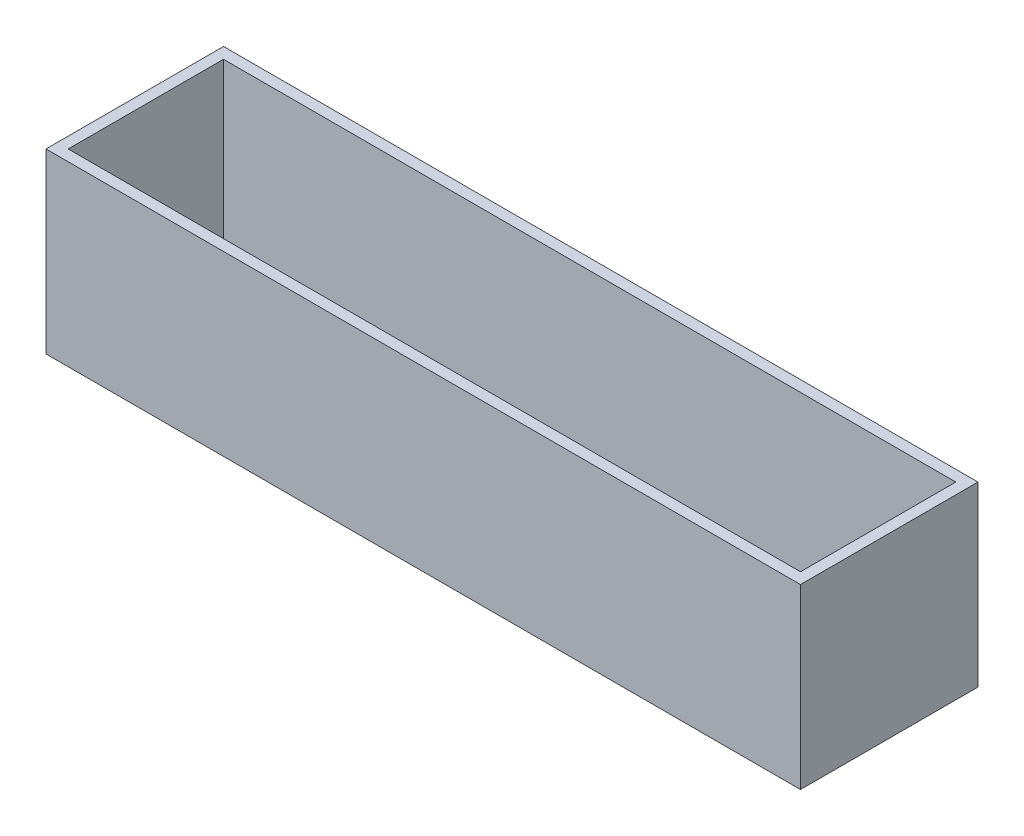
ISO-10303-21;
HEADER;
FILE_DESCRIPTION(('STEP AP214'),'2;1');
FILE_NAME('part.step','',(''),(''),'','','');
FILE_SCHEMA(('AUTOMOTIVE_DESIGN { 1 0 10303 214 1 1 1 1 }'));
ENDSEC;
DATA;
#1=APPLICATION_CONTEXT('core data for automotive mechanical design processes');
#2=APPLICATION_PROTOCOL_DEFINITION('international standard','automotive_design',2000,#1);
#3=PRODUCT_CONTEXT('',#1,'mechanical');
#4=PRODUCT('Part','Part','',(#3));
#5=PRODUCT_RELATED_PRODUCT_CATEGORY('part','',(#4));
#6=PRODUCT_DEFINITION_FORMATION('','',#4);
#7=PRODUCT_DEFINITION_CONTEXT('part definition',#1,'design');
#8=PRODUCT_DEFINITION('design','',#6,#7);
#9=PRODUCT_DEFINITION_SHAPE('','',#8);
#10=(LENGTH_UNIT() NAMED_UNIT(*) SI_UNIT(.MILLI.,.METRE.));
#11=(NAMED_UNIT(*) PLANE_ANGLE_UNIT() SI_UNIT($,.RADIAN.));
#12=(NAMED_UNIT(*) SI_UNIT($,.STERADIAN.) SOLID_ANGLE_UNIT());
#13=UNCERTAINTY_MEASURE_WITH_UNIT(LENGTH_MEASURE(1.E-05),#10,'distance_accuracy_value','');
#14=(GEOMETRIC_REPRESENTATION_CONTEXT(3) GLOBAL_UNCERTAINTY_ASSIGNED_CONTEXT((#13)) GLOBAL_UNIT_ASSIGNED_CONTEXT((#10,
#11,#12)) REPRESENTATION_CONTEXT('',''));
#15=CARTESIAN_POINT('',(0.,0.,0.));
#16=DIRECTION('',(0.,0.,1.));
#17=DIRECTION('',(1.,0.,0.));
#18=AXIS2_PLACEMENT_3D('',#15,#16,#17);
#19=CARTESIAN_POINT('',(-81.5730337078652,40.,-20.561797752809));
#20=DIRECTION('',(1.,0.,0.));
#21=DIRECTION('',(0.,0.,-1.));
#22=AXIS2_PLACEMENT_3D('',#19,#20,#21);
#23=PLANE('',#22);
#24=DIRECTION('',(0.,0.,1.));
#25=VECTOR('',#24,1.);
#26=CARTESIAN_POINT('',(-81.5730337078652,0.,-20.561797752809));
#27=LINE('',#26,#25);
#28=CARTESIAN_POINT('',(-81.5730337078652,0.,-20.561797752809));
#29=VERTEX_POINT('',#28);
#30=CARTESIAN_POINT('',(-81.5730337078652,0.,19.438202247191));
#31=VERTEX_POINT('',#30);
#32=EDGE_CURVE('E141',#29,#31,#27,.T.);
#33=ORIENTED_EDGE('',*,*,#32,.T.);
#34=DIRECTION('',(0.,-1.,0.));
#35=VECTOR('',#34,1.);
#36=CARTESIAN_POINT('',(-81.5730337078652,40.,19.438202247191));
#37=LINE('',#36,#35);
#38=CARTESIAN_POINT('',(-81.5730337078652,40.,19.438202247191));
#39=VERTEX_POINT('',#38);
#40=EDGE_CURVE('E11',#39,#31,#37,.T.);
#41=ORIENTED_EDGE('',*,*,#40,.F.);
#42=DIRECTION('',(0.,0.,1.));
#43=VECTOR('',#42,1.);
#44=CARTESIAN_POINT('',(-81.5730337078652,40.,-20.561797752809));
#45=LINE('',#44,#43);
#46=CARTESIAN_POINT('',(-81.5730337078652,40.,-20.561797752809));
#47=VERTEX_POINT('',#46);
#48=EDGE_CURVE('E145',#47,#39,#45,.T.);
#49=ORIENTED_EDGE('',*,*,#48,.F.);
#50=DIRECTION('',(0.,-1.,0.));
#51=VECTOR('',#50,1.);
#52=CARTESIAN_POINT('',(-81.5730337078652,40.,-20.561797752809));
#53=LINE('',#52,#51);
#54=EDGE_CURVE('E151',#47,#29,#53,.T.);
#55=ORIENTED_EDGE('',*,*,#54,.T.);
#56=EDGE_LOOP('',(#33,#41,#49,#55));
#57=FACE_BOUND('',#56,.T.);
#58=ADVANCED_FACE('F33',(#57),#23,.F.);
#59=CARTESIAN_POINT('',(-81.5730337078652,40.,19.438202247191));
#60=DIRECTION('',(0.,0.,-1.));
#61=DIRECTION('',(-1.,0.,0.));
#62=AXIS2_PLACEMENT_3D('',#59,#60,#61);
#63=PLANE('',#62);
#64=DIRECTION('',(1.,0.,0.));
#65=VECTOR('',#64,1.);
#66=CARTESIAN_POINT('',(-81.5730337078652,0.,19.438202247191));
#67=LINE('',#66,#65);
#68=CARTESIAN_POINT('',(88.4269662921348,0.,19.438202247191));
#69=VERTEX_POINT('',#68);
#70=EDGE_CURVE('E154',#31,#69,#67,.T.);
#71=ORIENTED_EDGE('',*,*,#70,.T.);
#72=DIRECTION('',(0.,-1.,0.));
#73=VECTOR('',#72,1.);
#74=CARTESIAN_POINT('',(88.4269662921348,40.,19.438202247191));
#75=LINE('',#74,#73);
#76=CARTESIAN_POINT('',(88.4269662921348,40.,19.438202247191));
#77=VERTEX_POINT('',#76);
#78=EDGE_CURVE('E40',#77,#69,#75,.T.);
#79=ORIENTED_EDGE('',*,*,#78,.F.);
#80=DIRECTION('',(1.,0.,0.));
#81=VECTOR('',#80,1.);
#82=CARTESIAN_POINT('',(-81.5730337078652,40.,19.438202247191));
#83=LINE('',#82,#81);
#84=EDGE_CURVE('E84',#39,#77,#83,.T.);
#85=ORIENTED_EDGE('',*,*,#84,.F.);
#86=ORIENTED_EDGE('',*,*,#40,.T.);
#87=EDGE_LOOP('',(#71,#79,#85,#86));
#88=FACE_BOUND('',#87,.T.);
#89=ADVANCED_FACE('F183',(#88),#63,.F.);
#90=CARTESIAN_POINT('',(88.4269662921348,40.,-20.561797752809));
#91=DIRECTION('',(-1.,0.,0.));
#92=DIRECTION('',(0.,0.,1.));
#93=AXIS2_PLACEMENT_3D('',#90,#91,#92);
#94=PLANE('',#93);
#95=DIRECTION('',(0.,0.,-1.));
#96=VECTOR('',#95,1.);
#97=CARTESIAN_POINT('',(88.4269662921348,0.,-20.561797752809));
#98=LINE('',#97,#96);
#99=CARTESIAN_POINT('',(88.4269662921348,0.,-20.561797752809));
#100=VERTEX_POINT('',#99);
#101=EDGE_CURVE('E156',#69,#100,#98,.T.);
#102=ORIENTED_EDGE('',*,*,#101,.T.);
#103=DIRECTION('',(0.,-1.,0.));
#104=VECTOR('',#103,1.);
#105=CARTESIAN_POINT('',(88.4269662921348,40.,-20.561797752809));
#106=LINE('',#105,#104);
#107=CARTESIAN_POINT('',(88.4269662921348,40.,-20.561797752809));
#108=VERTEX_POINT('',#107);
#109=EDGE_CURVE('E160',#108,#100,#106,.T.);
#110=ORIENTED_EDGE('',*,*,#109,.F.);
#111=DIRECTION('',(0.,0.,-1.));
#112=VECTOR('',#111,1.);
#113=CARTESIAN_POINT('',(88.4269662921348,40.,-20.561797752809));
#114=LINE('',#113,#112);
#115=EDGE_CURVE('E148',#77,#108,#114,.T.);
#116=ORIENTED_EDGE('',*,*,#115,.F.);
#117=ORIENTED_EDGE('',*,*,#78,.T.);
#118=EDGE_LOOP('',(#102,#110,#116,#117));
#119=FACE_BOUND('',#118,.T.);
#120=ADVANCED_FACE('F165',(#119),#94,.F.);
#121=CARTESIAN_POINT('',(-81.5730337078652,40.,-20.561797752809));
#122=DIRECTION('',(0.,0.,1.));
#123=DIRECTION('',(1.,0.,0.));
#124=AXIS2_PLACEMENT_3D('',#121,#122,#123);
#125=PLANE('',#124);
#126=DIRECTION('',(-1.,0.,0.));
#127=VECTOR('',#126,1.);
#128=CARTESIAN_POINT('',(-81.5730337078652,0.,-20.561797752809));
#129=LINE('',#128,#127);
#130=EDGE_CURVE('E77',#100,#29,#129,.T.);
#131=ORIENTED_EDGE('',*,*,#130,.T.);
#132=ORIENTED_EDGE('',*,*,#54,.F.);
#133=DIRECTION('',(-1.,0.,0.));
#134=VECTOR('',#133,1.);
#135=CARTESIAN_POINT('',(-81.5730337078652,40.,-20.561797752809));
#136=LINE('',#135,#134);
#137=EDGE_CURVE('E56',#108,#47,#136,.T.);
#138=ORIENTED_EDGE('',*,*,#137,.F.);
#139=ORIENTED_EDGE('',*,*,#109,.T.);
#140=EDGE_LOOP('',(#131,#132,#138,#139));
#141=FACE_BOUND('',#140,.T.);
#142=ADVANCED_FACE('F173',(#141),#125,.F.);
#143=CARTESIAN_POINT('',(0.,40.,0.));
#144=DIRECTION('',(0.,1.,0.));
#145=DIRECTION('',(0.,0.,1.));
#146=AXIS2_PLACEMENT_3D('',#143,#144,#145);
#147=PLANE('',#146);
#148=DIRECTION('',(0.,0.,1.));
#149=VECTOR('',#148,1.);
#150=CARTESIAN_POINT('',(-79.0730337078652,40.,-18.061797752809));
#151=LINE('',#150,#149);
#152=CARTESIAN_POINT('',(-79.0730337078652,40.,-18.061797752809));
#153=VERTEX_POINT('',#152);
#154=CARTESIAN_POINT('',(-79.0730337078652,40.,16.938202247191));
#155=VERTEX_POINT('',#154);
#156=EDGE_CURVE('E47',#153,#155,#151,.T.);
#157=ORIENTED_EDGE('',*,*,#156,.F.);
#158=DIRECTION('',(-1.,0.,0.));
#159=VECTOR('',#158,1.);
#160=CARTESIAN_POINT('',(-79.0730337078652,40.,-18.061797752809));
#161=LINE('',#160,#159);
#162=CARTESIAN_POINT('',(85.9269662921348,40.,-18.061797752809));
#163=VERTEX_POINT('',#162);
#164=EDGE_CURVE('E126',#163,#153,#161,.T.);
#165=ORIENTED_EDGE('',*,*,#164,.F.);
#166=DIRECTION('',(0.,0.,-1.));
#167=VECTOR('',#166,1.);
#168=CARTESIAN_POINT('',(85.9269662921348,40.,-18.061797752809));
#169=LINE('',#168,#167);
#170=CARTESIAN_POINT('',(85.9269662921348,40.,16.938202247191));
#171=VERTEX_POINT('',#170);
#172=EDGE_CURVE('E129',#171,#163,#169,.T.);
#173=ORIENTED_EDGE('',*,*,#172,.F.);
#174=DIRECTION('',(1.,0.,0.));
#175=VECTOR('',#174,1.);
#176=CARTESIAN_POINT('',(-79.0730337078652,40.,16.938202247191));
#177=LINE('',#176,#175);
#178=EDGE_CURVE('E135',#155,#171,#177,.T.);
#179=ORIENTED_EDGE('',*,*,#178,.F.);
#180=EDGE_LOOP('',(#157,#165,#173,#179));
#181=FACE_BOUND('',#180,.T.);
#182=ORIENTED_EDGE('',*,*,#48,.T.);
#183=ORIENTED_EDGE('',*,*,#84,.T.);
#184=ORIENTED_EDGE('',*,*,#115,.T.);
#185=ORIENTED_EDGE('',*,*,#137,.T.);
#186=EDGE_LOOP('',(#182,#183,#184,#185));
#187=FACE_BOUND('',#186,.T.);
#188=ADVANCED_FACE('F175',(#181,#187),#147,.T.);
#189=CARTESIAN_POINT('',(0.,0.,0.));
#190=DIRECTION('',(0.,1.,0.));
#191=DIRECTION('',(0.,0.,1.));
#192=AXIS2_PLACEMENT_3D('',#189,#190,#191);
#193=PLANE('',#192);
#194=ORIENTED_EDGE('',*,*,#32,.F.);
#195=ORIENTED_EDGE('',*,*,#130,.F.);
#196=ORIENTED_EDGE('',*,*,#101,.F.);
#197=ORIENTED_EDGE('',*,*,#70,.F.);
#198=EDGE_LOOP('',(#194,#195,#196,#197));
#199=FACE_BOUND('',#198,.T.);
#200=ADVANCED_FACE('F169',(#199),#193,.F.);
#201=CARTESIAN_POINT('',(-79.0730337078652,2.5,-18.061797752809));
#202=DIRECTION('',(-1.,0.,0.));
#203=DIRECTION('',(0.,0.,1.));
#204=AXIS2_PLACEMENT_3D('',#201,#202,#203);
#205=PLANE('',#204);
#206=ORIENTED_EDGE('',*,*,#156,.T.);
#207=DIRECTION('',(0.,1.,0.));
#208=VECTOR('',#207,1.);
#209=CARTESIAN_POINT('',(-79.0730337078652,2.5,16.938202247191));
#210=LINE('',#209,#208);
#211=CARTESIAN_POINT('',(-79.0730337078652,2.5,16.938202247191));
#212=VERTEX_POINT('',#211);
#213=EDGE_CURVE('E104',#212,#155,#210,.T.);
#214=ORIENTED_EDGE('',*,*,#213,.F.);
#215=DIRECTION('',(0.,0.,1.));
#216=VECTOR('',#215,1.);
#217=CARTESIAN_POINT('',(-79.0730337078652,2.5,-18.061797752809));
#218=LINE('',#217,#216);
#219=CARTESIAN_POINT('',(-79.0730337078652,2.5,-18.061797752809));
#220=VERTEX_POINT('',#219);
#221=EDGE_CURVE('E108',#220,#212,#218,.T.);
#222=ORIENTED_EDGE('',*,*,#221,.F.);
#223=DIRECTION('',(0.,1.,0.));
#224=VECTOR('',#223,1.);
#225=CARTESIAN_POINT('',(-79.0730337078652,2.5,-18.061797752809));
#226=LINE('',#225,#224);
#227=EDGE_CURVE('E139',#220,#153,#226,.T.);
#228=ORIENTED_EDGE('',*,*,#227,.T.);
#229=EDGE_LOOP('',(#206,#214,#222,#228));
#230=FACE_BOUND('',#229,.T.);
#231=ADVANCED_FACE('F106',(#230),#205,.F.);
#232=CARTESIAN_POINT('',(-79.0730337078652,2.5,-18.061797752809));
#233=DIRECTION('',(0.,0.,-1.));
#234=DIRECTION('',(-1.,0.,0.));
#235=AXIS2_PLACEMENT_3D('',#232,#233,#234);
#236=PLANE('',#235);
#237=ORIENTED_EDGE('',*,*,#164,.T.);
#238=ORIENTED_EDGE('',*,*,#227,.F.);
#239=DIRECTION('',(-1.,0.,0.));
#240=VECTOR('',#239,1.);
#241=CARTESIAN_POINT('',(-79.0730337078652,2.5,-18.061797752809));
#242=LINE('',#241,#240);
#243=CARTESIAN_POINT('',(85.9269662921348,2.5,-18.061797752809));
#244=VERTEX_POINT('',#243);
#245=EDGE_CURVE('E114',#244,#220,#242,.T.);
#246=ORIENTED_EDGE('',*,*,#245,.F.);
#247=DIRECTION('',(0.,1.,0.));
#248=VECTOR('',#247,1.);
#249=CARTESIAN_POINT('',(85.9269662921348,2.5,-18.061797752809));
#250=LINE('',#249,#248);
#251=EDGE_CURVE('E142',#244,#163,#250,.T.);
#252=ORIENTED_EDGE('',*,*,#251,.T.);
#253=EDGE_LOOP('',(#237,#238,#246,#252));
#254=FACE_BOUND('',#253,.T.);
#255=ADVANCED_FACE('F222',(#254),#236,.F.);
#256=CARTESIAN_POINT('',(85.9269662921348,2.5,-18.061797752809));
#257=DIRECTION('',(1.,0.,0.));
#258=DIRECTION('',(0.,0.,-1.));
#259=AXIS2_PLACEMENT_3D('',#256,#257,#258);
#260=PLANE('',#259);
#261=ORIENTED_EDGE('',*,*,#172,.T.);
#262=ORIENTED_EDGE('',*,*,#251,.F.);
#263=DIRECTION('',(0.,0.,-1.));
#264=VECTOR('',#263,1.);
#265=CARTESIAN_POINT('',(85.9269662921348,2.5,-18.061797752809));
#266=LINE('',#265,#264);
#267=CARTESIAN_POINT('',(85.9269662921348,2.5,16.938202247191));
#268=VERTEX_POINT('',#267);
#269=EDGE_CURVE('E122',#268,#244,#266,.T.);
#270=ORIENTED_EDGE('',*,*,#269,.F.);
#271=DIRECTION('',(0.,1.,0.));
#272=VECTOR('',#271,1.);
#273=CARTESIAN_POINT('',(85.9269662921348,2.5,16.938202247191));
#274=LINE('',#273,#272);
#275=EDGE_CURVE('E113',#268,#171,#274,.T.);
#276=ORIENTED_EDGE('',*,*,#275,.T.);
#277=EDGE_LOOP('',(#261,#262,#270,#276));
#278=FACE_BOUND('',#277,.T.);
#279=ADVANCED_FACE('F231',(#278),#260,.F.);
#280=CARTESIAN_POINT('',(-79.0730337078652,2.5,16.938202247191));
#281=DIRECTION('',(0.,0.,1.));
#282=DIRECTION('',(1.,0.,0.));
#283=AXIS2_PLACEMENT_3D('',#280,#281,#282);
#284=PLANE('',#283);
#285=ORIENTED_EDGE('',*,*,#178,.T.);
#286=ORIENTED_EDGE('',*,*,#275,.F.);
#287=DIRECTION('',(1.,0.,0.));
#288=VECTOR('',#287,1.);
#289=CARTESIAN_POINT('',(-79.0730337078652,2.5,16.938202247191));
#290=LINE('',#289,#288);
#291=EDGE_CURVE('E117',#212,#268,#290,.T.);
#292=ORIENTED_EDGE('',*,*,#291,.F.);
#293=ORIENTED_EDGE('',*,*,#213,.T.);
#294=EDGE_LOOP('',(#285,#286,#292,#293));
#295=FACE_BOUND('',#294,.T.);
#296=ADVANCED_FACE('F118',(#295),#284,.F.);
#297=CARTESIAN_POINT('',(0.,2.5,0.));
#298=DIRECTION('',(0.,1.,0.));
#299=DIRECTION('',(0.,0.,1.));
#300=AXIS2_PLACEMENT_3D('',#297,#298,#299);
#301=PLANE('',#300);
#302=ORIENTED_EDGE('',*,*,#221,.T.);
#303=ORIENTED_EDGE('',*,*,#291,.T.);
#304=ORIENTED_EDGE('',*,*,#269,.T.);
#305=ORIENTED_EDGE('',*,*,#245,.T.);
#306=EDGE_LOOP('',(#302,#303,#304,#305));
#307=FACE_BOUND('',#306,.T.);
#308=ADVANCED_FACE('F124',(#307),#301,.T.);
#309=CLOSED_SHELL('',(#58,#89,#120,#142,#188,#200,#231,#255,#279,#296,#308));
#310=MANIFOLD_SOLID_BREP('B2',#309);
#311=ADVANCED_BREP_SHAPE_REPRESENTATION('',(#18,#310),#14);
#312=SHAPE_DEFINITION_REPRESENTATION(#9,#311);
ENDSEC;
END-ISO-10303-21;
